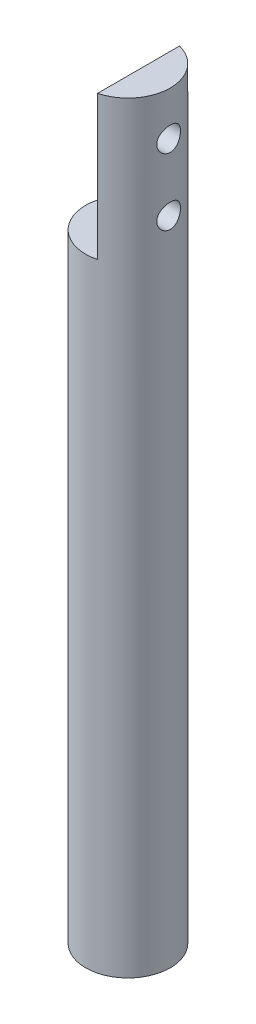
ISO-10303-21;
HEADER;
FILE_DESCRIPTION(('STEP AP214'),'2;1');
FILE_NAME('part.step','',(''),(''),'','','');
FILE_SCHEMA(('AUTOMOTIVE_DESIGN { 1 0 10303 214 1 1 1 1 }'));
ENDSEC;
DATA;
#1=APPLICATION_CONTEXT('core data for automotive mechanical design processes');
#2=APPLICATION_PROTOCOL_DEFINITION('international standard','automotive_design',2000,#1);
#3=PRODUCT_CONTEXT('',#1,'mechanical');
#4=PRODUCT('Part','Part','',(#3));
#5=PRODUCT_RELATED_PRODUCT_CATEGORY('part','',(#4));
#6=PRODUCT_DEFINITION_FORMATION('','',#4);
#7=PRODUCT_DEFINITION_CONTEXT('part definition',#1,'design');
#8=PRODUCT_DEFINITION('design','',#6,#7);
#9=PRODUCT_DEFINITION_SHAPE('','',#8);
#10=(LENGTH_UNIT() NAMED_UNIT(*) SI_UNIT(.MILLI.,.METRE.));
#11=(NAMED_UNIT(*) PLANE_ANGLE_UNIT() SI_UNIT($,.RADIAN.));
#12=(NAMED_UNIT(*) SI_UNIT($,.STERADIAN.) SOLID_ANGLE_UNIT());
#13=UNCERTAINTY_MEASURE_WITH_UNIT(LENGTH_MEASURE(1.E-05),#10,'distance_accuracy_value','');
#14=(GEOMETRIC_REPRESENTATION_CONTEXT(3) GLOBAL_UNCERTAINTY_ASSIGNED_CONTEXT((#13)) GLOBAL_UNIT_ASSIGNED_CONTEXT((#10,
#11,#12)) REPRESENTATION_CONTEXT('',''));
#15=CARTESIAN_POINT('',(0.,0.,0.));
#16=DIRECTION('',(0.,0.,1.));
#17=DIRECTION('',(1.,0.,0.));
#18=AXIS2_PLACEMENT_3D('',#15,#16,#17);
#19=CARTESIAN_POINT('',(0.,57.15,0.));
#20=DIRECTION('',(0.,-1.,0.));
#21=DIRECTION('',(0.,0.,-1.));
#22=AXIS2_PLACEMENT_3D('',#19,#20,#21);
#23=CYLINDRICAL_SURFACE('',#22,3.175);
#24=CARTESIAN_POINT('',(3.048,53.855,0.889));
#25=CARTESIAN_POINT('',(3.04800074144579,53.9038733654637,0.888999022704975));
#26=CARTESIAN_POINT('',(3.0491883536904,53.9527567364062,0.884956005900081));
#27=CARTESIAN_POINT('',(3.05379446473852,54.0491049848988,0.86892561421158));
#28=CARTESIAN_POINT('',(3.05721393512249,54.096569235257,0.856934779420127));
#29=CARTESIAN_POINT('',(3.06586679255467,54.1886712317961,0.825439260264912));
#30=CARTESIAN_POINT('',(3.07109744934927,54.2333131134177,0.80594588062788));
#31=CARTESIAN_POINT('',(3.08277975485952,54.3187015211283,0.76003475636559));
#32=CARTESIAN_POINT('',(3.0892315334209,54.3594476322734,0.733616275257371));
#33=CARTESIAN_POINT('',(3.10282851808416,54.4370111447716,0.673825649223518));
#34=CARTESIAN_POINT('',(3.10998700385331,54.4737052421074,0.640296533333315));
#35=CARTESIAN_POINT('',(3.12407666925912,54.5410299343499,0.567573542210274));
#36=CARTESIAN_POINT('',(3.13100782316884,54.5716598449399,0.528379028524614));
#37=CARTESIAN_POINT('',(3.14401109305889,54.6265090608122,0.444574237503614));
#38=CARTESIAN_POINT('',(3.15006572408435,54.6506045660182,0.399879985189847));
#39=CARTESIAN_POINT('',(3.16048064645674,54.6908915244847,0.306876342799879));
#40=CARTESIAN_POINT('',(3.16484125401579,54.7070844530113,0.258567629420829));
#41=CARTESIAN_POINT('',(3.17128288506878,54.7307040631926,0.160994613397916));
#42=CARTESIAN_POINT('',(3.17341843142117,54.7383407786606,0.111784817223569));
#43=CARTESIAN_POINT('',(3.17536048694193,54.7452932743307,0.0127392624770647));
#44=CARTESIAN_POINT('',(3.17516742430905,54.7446105843552,-0.0370963793271483));
#45=CARTESIAN_POINT('',(3.17251342098985,54.735088882728,-0.134512605209552));
#46=CARTESIAN_POINT('',(3.17011563326432,54.7264769888744,-0.18211737468884));
#47=CARTESIAN_POINT('',(3.16339697389186,54.7017098300263,-0.275176901920622));
#48=CARTESIAN_POINT('',(3.15907598732543,54.6855541142527,-0.320631531013265));
#49=CARTESIAN_POINT('',(3.14890524255914,54.6459918167282,-0.408664749201556));
#50=CARTESIAN_POINT('',(3.14303970776309,54.6225099164607,-0.451207592285719));
#51=CARTESIAN_POINT('',(3.1304081222126,54.5690202636264,-0.531824617738516));
#52=CARTESIAN_POINT('',(3.12364188079185,54.5390111284853,-0.569897850736414));
#53=CARTESIAN_POINT('',(3.10966917671264,54.472123673229,-0.64185082699832));
#54=CARTESIAN_POINT('',(3.1024555637627,54.4350476993962,-0.675545670788159));
#55=CARTESIAN_POINT('',(3.08860471608588,54.3556980560687,-0.736287397269033));
#56=CARTESIAN_POINT('',(3.0819675243892,54.3134239991019,-0.763333783924004));
#57=CARTESIAN_POINT('',(3.06999005425627,54.2244444097016,-0.810171227980408));
#58=CARTESIAN_POINT('',(3.06465973815351,54.1777083945776,-0.829907105431936));
#59=CARTESIAN_POINT('',(3.05602075215966,54.0813941993218,-0.861178446006272));
#60=CARTESIAN_POINT('',(3.05271152110212,54.0318168122998,-0.872716185537043));
#61=CARTESIAN_POINT('',(3.04861036820764,53.9329684098257,-0.88693469934459));
#62=CARTESIAN_POINT('',(3.04773950623862,53.8837405964397,-0.889893331949965));
#63=CARTESIAN_POINT('',(3.04839680667467,53.7854926125504,-0.887639246904802));
#64=CARTESIAN_POINT('',(3.04992468355344,53.7364724180303,-0.882427501789495));
#65=CARTESIAN_POINT('',(3.0551305705055,53.6411353392666,-0.864226581903412));
#66=CARTESIAN_POINT('',(3.05876110757367,53.5947828515508,-0.851408976918569));
#67=CARTESIAN_POINT('',(3.06771577424975,53.5048869252364,-0.818555399608298));
#68=CARTESIAN_POINT('',(3.07304014129867,53.4613438814956,-0.798518415218364));
#69=CARTESIAN_POINT('',(3.08494108557681,53.3771528913416,-0.751245255343617));
#70=CARTESIAN_POINT('',(3.09154455793357,53.336599053057,-0.723848410491956));
#71=CARTESIAN_POINT('',(3.10519857691837,53.2605624680078,-0.662829100750051));
#72=CARTESIAN_POINT('',(3.11224921630329,53.2250807783703,-0.629205341400976));
#73=CARTESIAN_POINT('',(3.12627846255595,53.1590184791837,-0.555393175540642));
#74=CARTESIAN_POINT('',(3.13324740753382,53.1286329109128,-0.515027982119803));
#75=CARTESIAN_POINT('',(3.14609634169483,53.0750663487539,-0.429610615302622));
#76=CARTESIAN_POINT('',(3.15197638840411,53.0518849742268,-0.384558689701356));
#77=CARTESIAN_POINT('',(3.16194727289417,53.013604157135,-0.291361546194213));
#78=CARTESIAN_POINT('',(3.16605159772319,52.9984435908583,-0.243242948857278));
#79=CARTESIAN_POINT('',(3.17206811720327,52.9764640428509,-0.145007590278837));
#80=CARTESIAN_POINT('',(3.17398085158866,52.969643007273,-0.0948913241610756));
#81=CARTESIAN_POINT('',(3.17537031148508,52.9646756462352,0.00410257465857598));
#82=CARTESIAN_POINT('',(3.17492700643421,52.9662445579541,0.0529649880377303));
#83=CARTESIAN_POINT('',(3.17183800207679,52.9773438045136,0.149702046305526));
#84=CARTESIAN_POINT('',(3.1691924010422,52.9868737841116,0.197576735171222));
#85=CARTESIAN_POINT('',(3.16201473209881,53.0134573009097,0.290599820702145));
#86=CARTESIAN_POINT('',(3.15749847230393,53.0304478626725,0.335767515655421));
#87=CARTESIAN_POINT('',(3.14704937045711,53.071414238752,0.422636400107661));
#88=CARTESIAN_POINT('',(3.1411163150138,53.0953911054345,0.464337066141583));
#89=CARTESIAN_POINT('',(3.12825099335539,53.1504535292501,0.544392318898718));
#90=CARTESIAN_POINT('',(3.12129485795685,53.1817240427912,0.582615836411658));
#91=CARTESIAN_POINT('',(3.10725567651361,53.2501422555483,0.653368888845674));
#92=CARTESIAN_POINT('',(3.10017259641915,53.287291553173,0.68589687010055));
#93=CARTESIAN_POINT('',(3.08647631222338,53.3675262150993,0.745143293434857));
#94=CARTESIAN_POINT('',(3.07987922601124,53.4107364855654,0.771696671947966));
#95=CARTESIAN_POINT('',(3.06814009982461,53.5011873096254,0.817126280627679));
#96=CARTESIAN_POINT('',(3.06299720300363,53.5484254684335,0.836007034585141));
#97=CARTESIAN_POINT('',(3.05538486849526,53.638669406351,0.863376907077115));
#98=CARTESIAN_POINT('',(3.05263934900825,53.6813225211211,0.872961556556881));
#99=CARTESIAN_POINT('',(3.0489467122479,53.7676478578347,0.885773084342433));
#100=CARTESIAN_POINT('',(3.04799933734046,53.8113199328759,0.889000873447365));
#101=CARTESIAN_POINT('',(3.048,53.855,0.889));
#102=B_SPLINE_CURVE_WITH_KNOTS('',3,(#24,#25,#26,#27,#28,#29,#30,#31,#32,#33,#34,#35,#36,#37,
#38,#39,#40,#41,#42,#43,#44,#45,#46,#47,#48,#49,#50,#51,#52,#53,#54,#55,#56,#57,#58,#59,#60,#61,
#62,#63,#64,#65,#66,#67,#68,#69,#70,#71,#72,#73,#74,#75,#76,#77,#78,#79,#80,#81,#82,#83,#84,#85,
#86,#87,#88,#89,#90,#91,#92,#93,#94,#95,#96,#97,#98,#99,#100,#101),.UNSPECIFIED.,.T.,.F.,(4,2,2,
2,2,2,2,2,2,2,2,2,2,2,2,2,2,2,2,2,2,2,2,2,2,2,2,2,2,2,2,2,2,2,2,2,2,2,4),(0.,0.146459287401067,
0.292982374544872,0.439285541729908,0.585604274540455,0.735571650820734,0.885555940626635,
1.03820968127062,1.19083491334784,1.33962536162133,1.48838844982117,1.63301874819051,
1.77765769001139,1.92383555425299,2.07004441154515,2.22118784811517,2.37234255795564,
2.52461599929672,2.6768471417545,2.82408956362908,2.97131446029551,3.1153382232534,
3.25938218435847,3.40687004300796,3.55438859610561,3.70666622842306,3.85893581366485,
4.01002765448382,4.1610822771287,4.30704320227681,4.45299761463259,4.59774301104066,
4.7425102221143,4.89144959773006,5.04042953893497,5.19312385990269,5.3457280209917,
5.47664325964223,5.60753973963556),.UNSPECIFIED.);
#103=CARTESIAN_POINT('',(3.048,53.855,0.889));
#104=VERTEX_POINT('',#103);
#105=EDGE_CURVE('E134',#104,#104,#102,.T.);
#106=ORIENTED_EDGE('',*,*,#105,.T.);
#107=EDGE_LOOP('',(#106));
#108=FACE_BOUND('',#107,.T.);
#109=CARTESIAN_POINT('',(3.048,48.855,0.889));
#110=CARTESIAN_POINT('',(3.04800074144579,48.9038733654637,0.888999022704976));
#111=CARTESIAN_POINT('',(3.0491883536904,48.9527567364062,0.884956005900081));
#112=CARTESIAN_POINT('',(3.05379446473852,49.0491049848988,0.868925614211581));
#113=CARTESIAN_POINT('',(3.05721393512249,49.096569235257,0.856934779420127));
#114=CARTESIAN_POINT('',(3.06586679255467,49.1886712317961,0.825439260264913));
#115=CARTESIAN_POINT('',(3.07109744934927,49.2333131134177,0.80594588062788));
#116=CARTESIAN_POINT('',(3.08277975485952,49.3187015211283,0.760034756365591));
#117=CARTESIAN_POINT('',(3.0892315334209,49.3594476322734,0.733616275257372));
#118=CARTESIAN_POINT('',(3.10282851808416,49.4370111447716,0.673825649223519));
#119=CARTESIAN_POINT('',(3.10998700385331,49.4737052421073,0.640296533333315));
#120=CARTESIAN_POINT('',(3.12407666925912,49.5410299343499,0.567573542210273));
#121=CARTESIAN_POINT('',(3.13100782316884,49.5716598449399,0.528379028524615));
#122=CARTESIAN_POINT('',(3.14401109305889,49.6265090608122,0.444574237503616));
#123=CARTESIAN_POINT('',(3.15006572408435,49.6506045660182,0.399879985189847));
#124=CARTESIAN_POINT('',(3.16048064645674,49.6908915244846,0.306876342799879));
#125=CARTESIAN_POINT('',(3.16484125401579,49.7070844530113,0.25856762942083));
#126=CARTESIAN_POINT('',(3.17128288506878,49.7307040631926,0.160994613397917));
#127=CARTESIAN_POINT('',(3.17341843142117,49.7383407786606,0.111784817223569));
#128=CARTESIAN_POINT('',(3.17536048694193,49.7452932743306,0.0127392624770652));
#129=CARTESIAN_POINT('',(3.17516742430905,49.7446105843552,-0.0370963793271478));
#130=CARTESIAN_POINT('',(3.17251342098985,49.735088882728,-0.134512605209552));
#131=CARTESIAN_POINT('',(3.17011563326432,49.7264769888744,-0.182117374688842));
#132=CARTESIAN_POINT('',(3.16339697389186,49.7017098300263,-0.275176901920624));
#133=CARTESIAN_POINT('',(3.15907598732543,49.6855541142527,-0.320631531013265));
#134=CARTESIAN_POINT('',(3.14890524255914,49.6459918167282,-0.408664749201556));
#135=CARTESIAN_POINT('',(3.14303970776309,49.6225099164607,-0.451207592285721));
#136=CARTESIAN_POINT('',(3.1304081222126,49.5690202636264,-0.531824617738518));
#137=CARTESIAN_POINT('',(3.12364188079185,49.5390111284853,-0.569897850736415));
#138=CARTESIAN_POINT('',(3.10966917671264,49.472123673229,-0.641850826998317));
#139=CARTESIAN_POINT('',(3.1024555637627,49.4350476993962,-0.675545670788154));
#140=CARTESIAN_POINT('',(3.08860471608588,49.3556980560687,-0.736287397269028));
#141=CARTESIAN_POINT('',(3.0819675243892,49.3134239991019,-0.763333783924003));
#142=CARTESIAN_POINT('',(3.06999005425627,49.2244444097016,-0.810171227980407));
#143=CARTESIAN_POINT('',(3.06465973815351,49.1777083945775,-0.829907105431934));
#144=CARTESIAN_POINT('',(3.05602075215966,49.0813941993218,-0.86117844600627));
#145=CARTESIAN_POINT('',(3.05271152110212,49.0318168122998,-0.872716185537042));
#146=CARTESIAN_POINT('',(3.04861036820764,48.9329684098257,-0.88693469934459));
#147=CARTESIAN_POINT('',(3.04773950623862,48.8837405964397,-0.889893331949965));
#148=CARTESIAN_POINT('',(3.04839680667467,48.7854926125504,-0.887639246904802));
#149=CARTESIAN_POINT('',(3.04992468355344,48.7364724180303,-0.882427501789494));
#150=CARTESIAN_POINT('',(3.0551305705055,48.6411353392666,-0.864226581903411));
#151=CARTESIAN_POINT('',(3.05876110757367,48.5947828515507,-0.851408976918569));
#152=CARTESIAN_POINT('',(3.06771577424975,48.5048869252364,-0.818555399608297));
#153=CARTESIAN_POINT('',(3.07304014129867,48.4613438814956,-0.798518415218363));
#154=CARTESIAN_POINT('',(3.08494108557681,48.3771528913416,-0.751245255343617));
#155=CARTESIAN_POINT('',(3.09154455793357,48.336599053057,-0.723848410491955));
#156=CARTESIAN_POINT('',(3.10519857691837,48.2605624680078,-0.66282910075005));
#157=CARTESIAN_POINT('',(3.11224921630329,48.2250807783703,-0.629205341400975));
#158=CARTESIAN_POINT('',(3.12627846255595,48.1590184791837,-0.555393175540641));
#159=CARTESIAN_POINT('',(3.13324740753382,48.1286329109128,-0.515027982119802));
#160=CARTESIAN_POINT('',(3.14609634169483,48.0750663487539,-0.429610615302621));
#161=CARTESIAN_POINT('',(3.15197638840411,48.0518849742268,-0.384558689701355));
#162=CARTESIAN_POINT('',(3.16194727289417,48.013604157135,-0.291361546194213));
#163=CARTESIAN_POINT('',(3.16605159772319,47.9984435908583,-0.243242948857277));
#164=CARTESIAN_POINT('',(3.17206811720327,47.9764640428509,-0.145007590278837));
#165=CARTESIAN_POINT('',(3.17398085158866,47.969643007273,-0.094891324161075));
#166=CARTESIAN_POINT('',(3.17537031148508,47.9646756462352,0.00410257465857676));
#167=CARTESIAN_POINT('',(3.17492700643421,47.9662445579541,0.0529649880377312));
#168=CARTESIAN_POINT('',(3.17183800207679,47.9773438045136,0.149702046305527));
#169=CARTESIAN_POINT('',(3.1691924010422,47.9868737841116,0.197576735171222));
#170=CARTESIAN_POINT('',(3.16201473209881,48.0134573009097,0.290599820702147));
#171=CARTESIAN_POINT('',(3.15749847230393,48.0304478626725,0.335767515655424));
#172=CARTESIAN_POINT('',(3.14704937045711,48.071414238752,0.422636400107665));
#173=CARTESIAN_POINT('',(3.1411163150138,48.0953911054345,0.464337066141584));
#174=CARTESIAN_POINT('',(3.12825099335539,48.1504535292501,0.544392318898719));
#175=CARTESIAN_POINT('',(3.12129485795685,48.1817240427912,0.582615836411659));
#176=CARTESIAN_POINT('',(3.10725567651361,48.2501422555483,0.653368888845675));
#177=CARTESIAN_POINT('',(3.10017259641915,48.287291553173,0.68589687010055));
#178=CARTESIAN_POINT('',(3.08647631222338,48.3675262150993,0.745143293434857));
#179=CARTESIAN_POINT('',(3.07987922601124,48.4107364855654,0.771696671947967));
#180=CARTESIAN_POINT('',(3.0681400998246,48.5011873096253,0.817126280627679));
#181=CARTESIAN_POINT('',(3.06299720300363,48.5484254684335,0.836007034585142));
#182=CARTESIAN_POINT('',(3.05538486849526,48.638669406351,0.863376907077116));
#183=CARTESIAN_POINT('',(3.05263934900825,48.6813225211211,0.872961556556881));
#184=CARTESIAN_POINT('',(3.0489467122479,48.7676478578347,0.885773084342434));
#185=CARTESIAN_POINT('',(3.04799933734046,48.8113199328759,0.889000873447365));
#186=CARTESIAN_POINT('',(3.048,48.855,0.889));
#187=B_SPLINE_CURVE_WITH_KNOTS('',3,(#109,#110,#111,#112,#113,#114,#115,#116,#117,#118,#119,
#120,#121,#122,#123,#124,#125,#126,#127,#128,#129,#130,#131,#132,#133,#134,#135,#136,#137,#138,
#139,#140,#141,#142,#143,#144,#145,#146,#147,#148,#149,#150,#151,#152,#153,#154,#155,#156,#157,
#158,#159,#160,#161,#162,#163,#164,#165,#166,#167,#168,#169,#170,#171,#172,#173,#174,#175,#176,
#177,#178,#179,#180,#181,#182,#183,#184,#185,#186),.UNSPECIFIED.,.T.,.F.,(4,2,2,2,2,2,2,2,2,2,2,
2,2,2,2,2,2,2,2,2,2,2,2,2,2,2,2,2,2,2,2,2,2,2,2,2,2,2,4),(0.,0.146459287401067,
0.292982374544872,0.439285541729908,0.585604274540455,0.735571650820729,0.885555940626634,
1.03820968127062,1.19083491334784,1.33962536162133,1.48838844982117,1.63301874819052,
1.77765769001139,1.923835554253,2.07004441154515,2.22118784811516,2.37234255795564,
2.52461599929671,2.6768471417545,2.82408956362907,2.97131446029551,3.1153382232534,
3.25938218435847,3.40687004300796,3.55438859610561,3.70666622842306,3.85893581366485,
4.01002765448382,4.1610822771287,4.30704320227681,4.45299761463259,4.59774301104066,
4.74251022211431,4.89144959773006,5.04042953893497,5.19312385990269,5.3457280209917,
5.47664325964223,5.60753973963556),.UNSPECIFIED.);
#188=CARTESIAN_POINT('',(3.048,48.855,0.889));
#189=VERTEX_POINT('',#188);
#190=EDGE_CURVE('E125',#189,#189,#187,.T.);
#191=ORIENTED_EDGE('',*,*,#190,.T.);
#192=EDGE_LOOP('',(#191));
#193=FACE_BOUND('',#192,.T.);
#194=CARTESIAN_POINT('',(0.,57.15,0.));
#195=DIRECTION('',(0.,1.,0.));
#196=DIRECTION('',(0.,0.,1.));
#197=AXIS2_PLACEMENT_3D('',#194,#195,#196);
#198=CIRCLE('',#197,3.175);
#199=CARTESIAN_POINT('',(0.794,57.15,3.07411597048648));
#200=VERTEX_POINT('',#199);
#201=CARTESIAN_POINT('',(0.794,57.15,-3.07411597048648));
#202=VERTEX_POINT('',#201);
#203=EDGE_CURVE('E178',#200,#202,#198,.T.);
#204=ORIENTED_EDGE('',*,*,#203,.F.);
#205=DIRECTION('',(0.,-1.,0.));
#206=VECTOR('',#205,1.);
#207=CARTESIAN_POINT('',(0.794,57.15,3.07411597048648));
#208=LINE('',#207,#206);
#209=CARTESIAN_POINT('',(0.794,46.355,3.07411597048648));
#210=VERTEX_POINT('',#209);
#211=EDGE_CURVE('E60',#200,#210,#208,.T.);
#212=ORIENTED_EDGE('',*,*,#211,.T.);
#213=CARTESIAN_POINT('',(0.,46.355,0.));
#214=DIRECTION('',(0.,-1.,0.));
#215=DIRECTION('',(0.,0.,-1.));
#216=AXIS2_PLACEMENT_3D('',#213,#214,#215);
#217=CIRCLE('',#216,3.175);
#218=CARTESIAN_POINT('',(0.794,46.355,-3.07411597048648));
#219=VERTEX_POINT('',#218);
#220=EDGE_CURVE('E189',#210,#219,#217,.T.);
#221=ORIENTED_EDGE('',*,*,#220,.T.);
#222=DIRECTION('',(0.,-1.,0.));
#223=VECTOR('',#222,1.);
#224=CARTESIAN_POINT('',(0.794,57.15,-3.07411597048648));
#225=LINE('',#224,#223);
#226=EDGE_CURVE('E185',#219,#202,#225,.F.);
#227=ORIENTED_EDGE('',*,*,#226,.T.);
#228=EDGE_LOOP('',(#204,#212,#221,#227));
#229=FACE_BOUND('',#228,.T.);
#230=CARTESIAN_POINT('',(0.,8.573,0.));
#231=DIRECTION('',(0.,1.,0.));
#232=DIRECTION('',(0.,0.,1.));
#233=AXIS2_PLACEMENT_3D('',#230,#231,#232);
#234=CIRCLE('',#233,3.175);
#235=CARTESIAN_POINT('',(1.94506884667068,8.573,-2.50944858120488));
#236=VERTEX_POINT('',#235);
#237=CARTESIAN_POINT('',(-1.98108864012754,8.573,-2.48111120265852));
#238=VERTEX_POINT('',#237);
#239=EDGE_CURVE('E11',#236,#238,#234,.T.);
#240=ORIENTED_EDGE('',*,*,#239,.T.);
#241=DIRECTION('',(0.,-1.,0.));
#242=VECTOR('',#241,1.);
#243=CARTESIAN_POINT('',(-1.98108864012754,57.15,-2.48111120265852));
#244=LINE('',#243,#242);
#245=CARTESIAN_POINT('',(-1.98108864012754,0.,-2.48111120265852));
#246=VERTEX_POINT('',#245);
#247=EDGE_CURVE('E118',#238,#246,#244,.T.);
#248=ORIENTED_EDGE('',*,*,#247,.T.);
#249=CARTESIAN_POINT('',(0.,0.,0.));
#250=DIRECTION('',(0.,1.,0.));
#251=DIRECTION('',(0.,0.,1.));
#252=AXIS2_PLACEMENT_3D('',#249,#250,#251);
#253=CIRCLE('',#252,3.175);
#254=CARTESIAN_POINT('',(1.94506884667068,0.,-2.50944858120488));
#255=VERTEX_POINT('',#254);
#256=EDGE_CURVE('E180',#246,#255,#253,.T.);
#257=ORIENTED_EDGE('',*,*,#256,.T.);
#258=DIRECTION('',(0.,-1.,0.));
#259=VECTOR('',#258,1.);
#260=CARTESIAN_POINT('',(1.94506884667068,57.15,-2.50944858120488));
#261=LINE('',#260,#259);
#262=EDGE_CURVE('E52',#255,#236,#261,.F.);
#263=ORIENTED_EDGE('',*,*,#262,.T.);
#264=EDGE_LOOP('',(#240,#248,#257,#263));
#265=FACE_BOUND('',#264,.T.);
#266=ADVANCED_FACE('F37',(#108,#193,#229,#265),#23,.T.);
#267=CARTESIAN_POINT('',(0.,57.15,0.));
#268=DIRECTION('',(0.,1.,0.));
#269=DIRECTION('',(0.,0.,1.));
#270=AXIS2_PLACEMENT_3D('',#267,#268,#269);
#271=PLANE('',#270);
#272=DIRECTION('',(0.,0.,-1.));
#273=VECTOR('',#272,1.);
#274=CARTESIAN_POINT('',(0.794,57.15,0.));
#275=LINE('',#274,#273);
#276=EDGE_CURVE('E183',#200,#202,#275,.T.);
#277=ORIENTED_EDGE('',*,*,#276,.F.);
#278=ORIENTED_EDGE('',*,*,#203,.T.);
#279=EDGE_LOOP('',(#277,#278));
#280=FACE_BOUND('',#279,.T.);
#281=ADVANCED_FACE('F157',(#280),#271,.T.);
#282=CARTESIAN_POINT('',(0.,0.,0.));
#283=DIRECTION('',(0.,1.,0.));
#284=DIRECTION('',(0.,0.,1.));
#285=AXIS2_PLACEMENT_3D('',#282,#283,#284);
#286=PLANE('',#285);
#287=ORIENTED_EDGE('',*,*,#256,.F.);
#288=DIRECTION('',(0.,0.,-1.));
#289=VECTOR('',#288,1.);
#290=CARTESIAN_POINT('',(-1.98108864012754,0.,-3.175));
#291=LINE('',#290,#289);
#292=CARTESIAN_POINT('',(-1.98108864012754,0.,-2.38125));
#293=VERTEX_POINT('',#292);
#294=EDGE_CURVE('E112',#293,#246,#291,.T.);
#295=ORIENTED_EDGE('',*,*,#294,.F.);
#296=DIRECTION('',(-1.,0.,0.));
#297=VECTOR('',#296,1.);
#298=CARTESIAN_POINT('',(-1.98108864012754,0.,-2.38125));
#299=LINE('',#298,#297);
#300=CARTESIAN_POINT('',(1.94506884667068,0.,-2.38125));
#301=VERTEX_POINT('',#300);
#302=EDGE_CURVE('E114',#301,#293,#299,.T.);
#303=ORIENTED_EDGE('',*,*,#302,.F.);
#304=DIRECTION('',(0.,0.,-1.));
#305=VECTOR('',#304,1.);
#306=CARTESIAN_POINT('',(1.94506884667068,0.,0.));
#307=LINE('',#306,#305);
#308=EDGE_CURVE('E45',#301,#255,#307,.T.);
#309=ORIENTED_EDGE('',*,*,#308,.T.);
#310=EDGE_LOOP('',(#287,#295,#303,#309));
#311=FACE_BOUND('',#310,.T.);
#312=ADVANCED_FACE('F152',(#311),#286,.F.);
#313=CARTESIAN_POINT('',(0.,46.355,0.));
#314=DIRECTION('',(0.,-1.,0.));
#315=DIRECTION('',(0.,0.,-1.));
#316=AXIS2_PLACEMENT_3D('',#313,#314,#315);
#317=PLANE('',#316);
#318=ORIENTED_EDGE('',*,*,#220,.F.);
#319=DIRECTION('',(0.,0.,-1.));
#320=VECTOR('',#319,1.);
#321=CARTESIAN_POINT('',(0.794,46.355,-3.175));
#322=LINE('',#321,#320);
#323=EDGE_CURVE('E263',#210,#219,#322,.T.);
#324=ORIENTED_EDGE('',*,*,#323,.T.);
#325=EDGE_LOOP('',(#318,#324));
#326=FACE_BOUND('',#325,.T.);
#327=ADVANCED_FACE('F149',(#326),#317,.F.);
#328=CARTESIAN_POINT('',(0.794,46.355,-3.175));
#329=DIRECTION('',(1.,0.,0.));
#330=DIRECTION('',(0.,0.,-1.));
#331=AXIS2_PLACEMENT_3D('',#328,#329,#330);
#332=PLANE('',#331);
#333=CARTESIAN_POINT('',(0.794,53.855,0.));
#334=DIRECTION('',(-1.,0.,0.));
#335=DIRECTION('',(0.,0.,1.));
#336=AXIS2_PLACEMENT_3D('',#333,#334,#335);
#337=CIRCLE('',#336,0.888999999999999);
#338=CARTESIAN_POINT('',(0.794,53.855,0.889));
#339=VERTEX_POINT('',#338);
#340=EDGE_CURVE('E122',#339,#339,#337,.T.);
#341=ORIENTED_EDGE('',*,*,#340,.F.);
#342=EDGE_LOOP('',(#341));
#343=FACE_BOUND('',#342,.T.);
#344=CARTESIAN_POINT('',(0.794,48.855,0.));
#345=DIRECTION('',(-1.,0.,0.));
#346=DIRECTION('',(0.,0.,1.));
#347=AXIS2_PLACEMENT_3D('',#344,#345,#346);
#348=CIRCLE('',#347,0.888999999999999);
#349=CARTESIAN_POINT('',(0.794,48.855,0.889));
#350=VERTEX_POINT('',#349);
#351=EDGE_CURVE('E121',#350,#350,#348,.T.);
#352=ORIENTED_EDGE('',*,*,#351,.F.);
#353=EDGE_LOOP('',(#352));
#354=FACE_BOUND('',#353,.T.);
#355=ORIENTED_EDGE('',*,*,#276,.T.);
#356=ORIENTED_EDGE('',*,*,#226,.F.);
#357=ORIENTED_EDGE('',*,*,#323,.F.);
#358=ORIENTED_EDGE('',*,*,#211,.F.);
#359=EDGE_LOOP('',(#355,#356,#357,#358));
#360=FACE_BOUND('',#359,.T.);
#361=ADVANCED_FACE('F145',(#343,#354,#360),#332,.F.);
#362=CARTESIAN_POINT('',(11.589,48.855,0.));
#363=DIRECTION('',(-1.,0.,0.));
#364=DIRECTION('',(0.,0.,1.));
#365=AXIS2_PLACEMENT_3D('',#362,#363,#364);
#366=CYLINDRICAL_SURFACE('',#365,0.888999999999999);
#367=ORIENTED_EDGE('',*,*,#351,.T.);
#368=EDGE_LOOP('',(#367));
#369=FACE_BOUND('',#368,.T.);
#370=ORIENTED_EDGE('',*,*,#190,.F.);
#371=EDGE_LOOP('',(#370));
#372=FACE_BOUND('',#371,.T.);
#373=ADVANCED_FACE('F140',(#369,#372),#366,.F.);
#374=CARTESIAN_POINT('',(11.589,53.855,0.));
#375=DIRECTION('',(-1.,0.,0.));
#376=DIRECTION('',(0.,0.,1.));
#377=AXIS2_PLACEMENT_3D('',#374,#375,#376);
#378=CYLINDRICAL_SURFACE('',#377,0.888999999999999);
#379=ORIENTED_EDGE('',*,*,#340,.T.);
#380=EDGE_LOOP('',(#379));
#381=FACE_BOUND('',#380,.T.);
#382=ORIENTED_EDGE('',*,*,#105,.F.);
#383=EDGE_LOOP('',(#382));
#384=FACE_BOUND('',#383,.T.);
#385=ADVANCED_FACE('F144',(#381,#384),#378,.F.);
#386=CARTESIAN_POINT('',(0.,8.573,0.));
#387=DIRECTION('',(0.,1.,0.));
#388=DIRECTION('',(0.,0.,1.));
#389=AXIS2_PLACEMENT_3D('',#386,#387,#388);
#390=PLANE('',#389);
#391=DIRECTION('',(0.,0.,1.));
#392=VECTOR('',#391,1.);
#393=CARTESIAN_POINT('',(1.94506884667068,8.573,-2.38125));
#394=LINE('',#393,#392);
#395=CARTESIAN_POINT('',(1.94506884667068,8.573,-2.38125));
#396=VERTEX_POINT('',#395);
#397=EDGE_CURVE('E91',#236,#396,#394,.T.);
#398=ORIENTED_EDGE('',*,*,#397,.T.);
#399=DIRECTION('',(-1.,0.,0.));
#400=VECTOR('',#399,1.);
#401=CARTESIAN_POINT('',(-1.98108864012754,8.573,-2.38125));
#402=LINE('',#401,#400);
#403=CARTESIAN_POINT('',(-1.98108864012754,8.573,-2.38125));
#404=VERTEX_POINT('',#403);
#405=EDGE_CURVE('E96',#396,#404,#402,.T.);
#406=ORIENTED_EDGE('',*,*,#405,.T.);
#407=DIRECTION('',(0.,0.,-1.));
#408=VECTOR('',#407,1.);
#409=CARTESIAN_POINT('',(-1.98108864012754,8.573,-3.175));
#410=LINE('',#409,#408);
#411=EDGE_CURVE('E97',#404,#238,#410,.T.);
#412=ORIENTED_EDGE('',*,*,#411,.T.);
#413=ORIENTED_EDGE('',*,*,#239,.F.);
#414=EDGE_LOOP('',(#398,#406,#412,#413));
#415=FACE_BOUND('',#414,.T.);
#416=ADVANCED_FACE('F93',(#415),#390,.F.);
#417=CARTESIAN_POINT('',(-1.98108864012754,8.573,-3.175));
#418=DIRECTION('',(-1.,0.,0.));
#419=DIRECTION('',(0.,0.,1.));
#420=AXIS2_PLACEMENT_3D('',#417,#418,#419);
#421=PLANE('',#420);
#422=ORIENTED_EDGE('',*,*,#411,.F.);
#423=DIRECTION('',(0.,-1.,0.));
#424=VECTOR('',#423,1.);
#425=CARTESIAN_POINT('',(-1.98108864012754,8.573,-2.38125));
#426=LINE('',#425,#424);
#427=EDGE_CURVE('E105',#404,#293,#426,.T.);
#428=ORIENTED_EDGE('',*,*,#427,.T.);
#429=ORIENTED_EDGE('',*,*,#294,.T.);
#430=ORIENTED_EDGE('',*,*,#247,.F.);
#431=EDGE_LOOP('',(#422,#428,#429,#430));
#432=FACE_BOUND('',#431,.T.);
#433=ADVANCED_FACE('F191',(#432),#421,.F.);
#434=CARTESIAN_POINT('',(1.94506884667068,8.573,-2.38125));
#435=DIRECTION('',(1.,0.,0.));
#436=DIRECTION('',(0.,0.,-1.));
#437=AXIS2_PLACEMENT_3D('',#434,#435,#436);
#438=PLANE('',#437);
#439=ORIENTED_EDGE('',*,*,#308,.F.);
#440=DIRECTION('',(0.,-1.,0.));
#441=VECTOR('',#440,1.);
#442=CARTESIAN_POINT('',(1.94506884667068,8.573,-2.38125));
#443=LINE('',#442,#441);
#444=EDGE_CURVE('E100',#396,#301,#443,.T.);
#445=ORIENTED_EDGE('',*,*,#444,.F.);
#446=ORIENTED_EDGE('',*,*,#397,.F.);
#447=ORIENTED_EDGE('',*,*,#262,.F.);
#448=EDGE_LOOP('',(#439,#445,#446,#447));
#449=FACE_BOUND('',#448,.T.);
#450=ADVANCED_FACE('F101',(#449),#438,.F.);
#451=CARTESIAN_POINT('',(-1.98108864012754,8.573,-2.38125));
#452=DIRECTION('',(0.,0.,1.));
#453=DIRECTION('',(1.,0.,0.));
#454=AXIS2_PLACEMENT_3D('',#451,#452,#453);
#455=PLANE('',#454);
#456=ORIENTED_EDGE('',*,*,#302,.T.);
#457=ORIENTED_EDGE('',*,*,#427,.F.);
#458=ORIENTED_EDGE('',*,*,#405,.F.);
#459=ORIENTED_EDGE('',*,*,#444,.T.);
#460=EDGE_LOOP('',(#456,#457,#458,#459));
#461=FACE_BOUND('',#460,.T.);
#462=ADVANCED_FACE('F107',(#461),#455,.F.);
#463=CLOSED_SHELL('',(#266,#281,#312,#327,#361,#373,#385,#416,#433,#450,#462));
#464=MANIFOLD_SOLID_BREP('B2',#463);
#465=ADVANCED_BREP_SHAPE_REPRESENTATION('',(#18,#464),#14);
#466=SHAPE_DEFINITION_REPRESENTATION(#9,#465);
ENDSEC;
END-ISO-10303-21;
